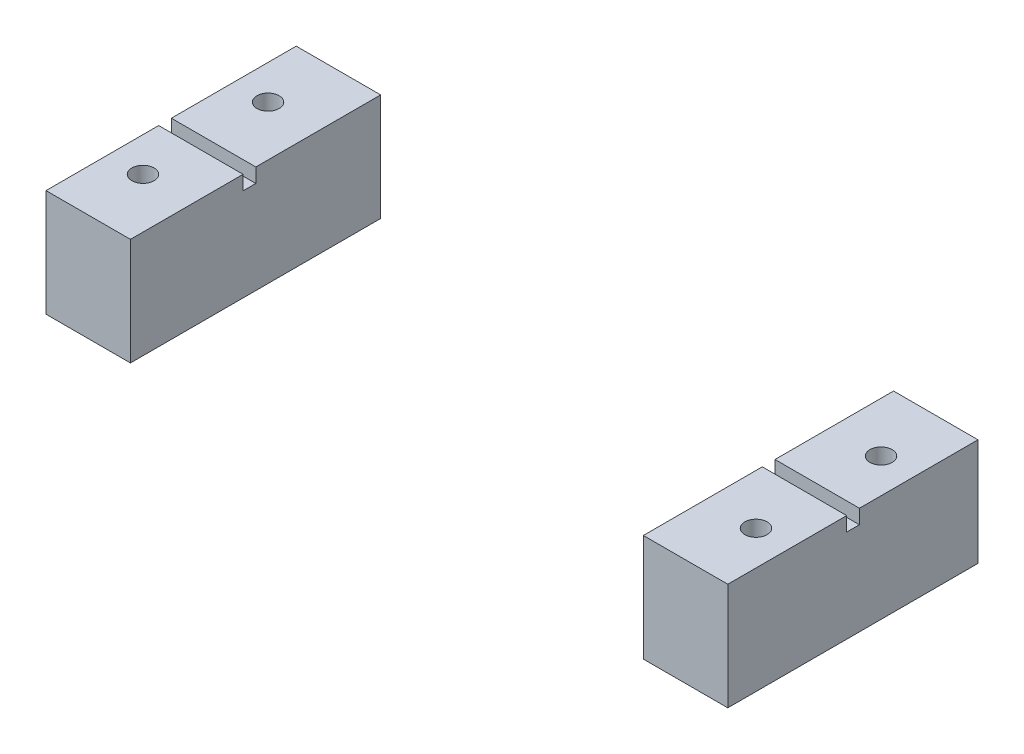
ISO-10303-21;
HEADER;
FILE_DESCRIPTION(('STEP AP214'),'2;1');
FILE_NAME('part.step','',(''),(''),'','','');
FILE_SCHEMA(('AUTOMOTIVE_DESIGN { 1 0 10303 214 1 1 1 1 }'));
ENDSEC;
DATA;
#1=APPLICATION_CONTEXT('core data for automotive mechanical design processes');
#2=APPLICATION_PROTOCOL_DEFINITION('international standard','automotive_design',2000,#1);
#3=PRODUCT_CONTEXT('',#1,'mechanical');
#4=PRODUCT('Part','Part','',(#3));
#5=PRODUCT_RELATED_PRODUCT_CATEGORY('part','',(#4));
#6=PRODUCT_DEFINITION_FORMATION('','',#4);
#7=PRODUCT_DEFINITION_CONTEXT('part definition',#1,'design');
#8=PRODUCT_DEFINITION('design','',#6,#7);
#9=PRODUCT_DEFINITION_SHAPE('','',#8);
#10=(LENGTH_UNIT() NAMED_UNIT(*) SI_UNIT(.MILLI.,.METRE.));
#11=(NAMED_UNIT(*) PLANE_ANGLE_UNIT() SI_UNIT($,.RADIAN.));
#12=(NAMED_UNIT(*) SI_UNIT($,.STERADIAN.) SOLID_ANGLE_UNIT());
#13=UNCERTAINTY_MEASURE_WITH_UNIT(LENGTH_MEASURE(1.E-05),#10,'distance_accuracy_value','');
#14=(GEOMETRIC_REPRESENTATION_CONTEXT(3) GLOBAL_UNCERTAINTY_ASSIGNED_CONTEXT((#13)) GLOBAL_UNIT_ASSIGNED_CONTEXT((#10,
#11,#12)) REPRESENTATION_CONTEXT('',''));
#15=CARTESIAN_POINT('',(0.,0.,0.));
#16=DIRECTION('',(0.,0.,1.));
#17=DIRECTION('',(1.,0.,0.));
#18=AXIS2_PLACEMENT_3D('',#15,#16,#17);
#19=CARTESIAN_POINT('',(0.,8.5598,0.));
#20=DIRECTION('',(0.,1.,0.));
#21=DIRECTION('',(0.,0.,1.));
#22=AXIS2_PLACEMENT_3D('',#19,#20,#21);
#23=PLANE('',#22);
#24=DIRECTION('',(-1.,0.,0.));
#25=VECTOR('',#24,1.);
#26=CARTESIAN_POINT('',(54.5,8.5598,-10.5214854290003));
#27=LINE('',#26,#25);
#28=CARTESIAN_POINT('',(54.5,8.5598,-10.5214854290003));
#29=VERTEX_POINT('',#28);
#30=CARTESIAN_POINT('',(47.75,8.5598,-10.5214854290003));
#31=VERTEX_POINT('',#30);
#32=EDGE_CURVE('E134',#29,#31,#27,.T.);
#33=ORIENTED_EDGE('',*,*,#32,.F.);
#34=DIRECTION('',(0.,0.,-1.));
#35=VECTOR('',#34,1.);
#36=CARTESIAN_POINT('',(54.5,8.5598,0.));
#37=LINE('',#36,#35);
#38=CARTESIAN_POINT('',(54.5,8.5598,-20.));
#39=VERTEX_POINT('',#38);
#40=EDGE_CURVE('E69',#29,#39,#37,.T.);
#41=ORIENTED_EDGE('',*,*,#40,.T.);
#42=DIRECTION('',(1.,0.,0.));
#43=VECTOR('',#42,1.);
#44=CARTESIAN_POINT('',(0.,8.5598,-20.));
#45=LINE('',#44,#43);
#46=CARTESIAN_POINT('',(47.75,8.5598,-20.));
#47=VERTEX_POINT('',#46);
#48=EDGE_CURVE('E149',#47,#39,#45,.T.);
#49=ORIENTED_EDGE('',*,*,#48,.F.);
#50=DIRECTION('',(0.,0.,-1.));
#51=VECTOR('',#50,1.);
#52=CARTESIAN_POINT('',(47.75,8.5598,0.));
#53=LINE('',#52,#51);
#54=EDGE_CURVE('E97',#31,#47,#53,.T.);
#55=ORIENTED_EDGE('',*,*,#54,.F.);
#56=EDGE_LOOP('',(#33,#41,#49,#55));
#57=FACE_BOUND('',#56,.T.);
#58=CARTESIAN_POINT('',(51.75,8.5598,-15.));
#59=DIRECTION('',(0.,1.,0.));
#60=DIRECTION('',(0.,0.,1.));
#61=AXIS2_PLACEMENT_3D('',#58,#59,#60);
#62=CIRCLE('',#61,0.889000000000003);
#63=CARTESIAN_POINT('',(51.75,8.5598,-14.111));
#64=VERTEX_POINT('',#63);
#65=EDGE_CURVE('E146',#64,#64,#62,.T.);
#66=ORIENTED_EDGE('',*,*,#65,.F.);
#67=EDGE_LOOP('',(#66));
#68=FACE_BOUND('',#67,.T.);
#69=ADVANCED_FACE('F45',(#57,#68),#23,.T.);
#70=CARTESIAN_POINT('',(0.,8.5598,-20.));
#71=DIRECTION('',(0.,0.,-1.));
#72=DIRECTION('',(-1.,0.,0.));
#73=AXIS2_PLACEMENT_3D('',#70,#71,#72);
#74=PLANE('',#73);
#75=DIRECTION('',(1.,0.,0.));
#76=VECTOR('',#75,1.);
#77=CARTESIAN_POINT('',(0.,0.,-20.));
#78=LINE('',#77,#76);
#79=CARTESIAN_POINT('',(47.75,0.,-20.));
#80=VERTEX_POINT('',#79);
#81=CARTESIAN_POINT('',(54.5,0.,-20.));
#82=VERTEX_POINT('',#81);
#83=EDGE_CURVE('E165',#80,#82,#78,.T.);
#84=ORIENTED_EDGE('',*,*,#83,.F.);
#85=DIRECTION('',(0.,-1.,0.));
#86=VECTOR('',#85,1.);
#87=CARTESIAN_POINT('',(47.75,8.5598,-20.));
#88=LINE('',#87,#86);
#89=EDGE_CURVE('E12',#47,#80,#88,.T.);
#90=ORIENTED_EDGE('',*,*,#89,.F.);
#91=ORIENTED_EDGE('',*,*,#48,.T.);
#92=DIRECTION('',(0.,-1.,0.));
#93=VECTOR('',#92,1.);
#94=CARTESIAN_POINT('',(54.5,8.5598,-20.));
#95=LINE('',#94,#93);
#96=EDGE_CURVE('E90',#39,#82,#95,.T.);
#97=ORIENTED_EDGE('',*,*,#96,.T.);
#98=EDGE_LOOP('',(#84,#90,#91,#97));
#99=FACE_BOUND('',#98,.T.);
#100=ADVANCED_FACE('F191',(#99),#74,.T.);
#101=CARTESIAN_POINT('',(47.75,8.5598,0.));
#102=DIRECTION('',(-1.,0.,0.));
#103=DIRECTION('',(0.,0.,1.));
#104=AXIS2_PLACEMENT_3D('',#101,#102,#103);
#105=PLANE('',#104);
#106=DIRECTION('',(0.,1.,0.));
#107=VECTOR('',#106,1.);
#108=CARTESIAN_POINT('',(47.75,7.4168,-10.5214854290003));
#109=LINE('',#108,#107);
#110=CARTESIAN_POINT('',(47.75,7.4168,-10.5214854290003));
#111=VERTEX_POINT('',#110);
#112=EDGE_CURVE('E166',#111,#31,#109,.T.);
#113=ORIENTED_EDGE('',*,*,#112,.T.);
#114=ORIENTED_EDGE('',*,*,#54,.T.);
#115=ORIENTED_EDGE('',*,*,#89,.T.);
#116=DIRECTION('',(0.,0.,-1.));
#117=VECTOR('',#116,1.);
#118=CARTESIAN_POINT('',(47.75,0.,0.));
#119=LINE('',#118,#117);
#120=CARTESIAN_POINT('',(47.75,0.,0.));
#121=VERTEX_POINT('',#120);
#122=EDGE_CURVE('E169',#121,#80,#119,.T.);
#123=ORIENTED_EDGE('',*,*,#122,.F.);
#124=DIRECTION('',(0.,-1.,0.));
#125=VECTOR('',#124,1.);
#126=CARTESIAN_POINT('',(47.75,8.5598,0.));
#127=LINE('',#126,#125);
#128=CARTESIAN_POINT('',(47.75,8.5598,0.));
#129=VERTEX_POINT('',#128);
#130=EDGE_CURVE('E53',#129,#121,#127,.T.);
#131=ORIENTED_EDGE('',*,*,#130,.F.);
#132=CARTESIAN_POINT('',(47.75,8.5598,-9.50548542900026));
#133=VERTEX_POINT('',#132);
#134=EDGE_CURVE('E139',#129,#133,#53,.T.);
#135=ORIENTED_EDGE('',*,*,#134,.T.);
#136=DIRECTION('',(0.,1.,0.));
#137=VECTOR('',#136,1.);
#138=CARTESIAN_POINT('',(47.75,7.4168,-9.50548542900026));
#139=LINE('',#138,#137);
#140=CARTESIAN_POINT('',(47.75,7.4168,-9.50548542900026));
#141=VERTEX_POINT('',#140);
#142=EDGE_CURVE('E60',#141,#133,#139,.T.);
#143=ORIENTED_EDGE('',*,*,#142,.F.);
#144=DIRECTION('',(0.,0.,1.));
#145=VECTOR('',#144,1.);
#146=CARTESIAN_POINT('',(47.75,7.4168,-10.5214854290003));
#147=LINE('',#146,#145);
#148=EDGE_CURVE('E127',#111,#141,#147,.T.);
#149=ORIENTED_EDGE('',*,*,#148,.F.);
#150=EDGE_LOOP('',(#113,#114,#115,#123,#131,#135,#143,#149));
#151=FACE_BOUND('',#150,.T.);
#152=ADVANCED_FACE('F137',(#151),#105,.T.);
#153=CARTESIAN_POINT('',(0.,8.5598,0.));
#154=DIRECTION('',(0.,0.,-1.));
#155=DIRECTION('',(-1.,0.,0.));
#156=AXIS2_PLACEMENT_3D('',#153,#154,#155);
#157=PLANE('',#156);
#158=DIRECTION('',(1.,0.,0.));
#159=VECTOR('',#158,1.);
#160=CARTESIAN_POINT('',(0.,0.,0.));
#161=LINE('',#160,#159);
#162=CARTESIAN_POINT('',(54.5,0.,0.));
#163=VERTEX_POINT('',#162);
#164=EDGE_CURVE('E172',#121,#163,#161,.T.);
#165=ORIENTED_EDGE('',*,*,#164,.T.);
#166=DIRECTION('',(0.,-1.,0.));
#167=VECTOR('',#166,1.);
#168=CARTESIAN_POINT('',(54.5,8.5598,0.));
#169=LINE('',#168,#167);
#170=CARTESIAN_POINT('',(54.5,8.5598,0.));
#171=VERTEX_POINT('',#170);
#172=EDGE_CURVE('E180',#171,#163,#169,.T.);
#173=ORIENTED_EDGE('',*,*,#172,.F.);
#174=DIRECTION('',(1.,0.,0.));
#175=VECTOR('',#174,1.);
#176=CARTESIAN_POINT('',(0.,8.5598,0.));
#177=LINE('',#176,#175);
#178=EDGE_CURVE('E153',#129,#171,#177,.T.);
#179=ORIENTED_EDGE('',*,*,#178,.F.);
#180=ORIENTED_EDGE('',*,*,#130,.T.);
#181=EDGE_LOOP('',(#165,#173,#179,#180));
#182=FACE_BOUND('',#181,.T.);
#183=ADVANCED_FACE('F185',(#182),#157,.F.);
#184=CARTESIAN_POINT('',(54.5,8.5598,0.));
#185=DIRECTION('',(-1.,0.,0.));
#186=DIRECTION('',(0.,0.,1.));
#187=AXIS2_PLACEMENT_3D('',#184,#185,#186);
#188=PLANE('',#187);
#189=ORIENTED_EDGE('',*,*,#40,.F.);
#190=DIRECTION('',(0.,1.,0.));
#191=VECTOR('',#190,1.);
#192=CARTESIAN_POINT('',(54.5,7.4168,-10.5214854290003));
#193=LINE('',#192,#191);
#194=CARTESIAN_POINT('',(54.5,7.4168,-10.5214854290003));
#195=VERTEX_POINT('',#194);
#196=EDGE_CURVE('E141',#195,#29,#193,.T.);
#197=ORIENTED_EDGE('',*,*,#196,.F.);
#198=DIRECTION('',(0.,0.,-1.));
#199=VECTOR('',#198,1.);
#200=CARTESIAN_POINT('',(54.5,7.4168,-10.5214854290003));
#201=LINE('',#200,#199);
#202=CARTESIAN_POINT('',(54.5,7.4168,-9.50548542900026));
#203=VERTEX_POINT('',#202);
#204=EDGE_CURVE('E126',#203,#195,#201,.T.);
#205=ORIENTED_EDGE('',*,*,#204,.F.);
#206=DIRECTION('',(0.,1.,0.));
#207=VECTOR('',#206,1.);
#208=CARTESIAN_POINT('',(54.5,7.4168,-9.50548542900026));
#209=LINE('',#208,#207);
#210=CARTESIAN_POINT('',(54.5,8.5598,-9.50548542900026));
#211=VERTEX_POINT('',#210);
#212=EDGE_CURVE('E123',#203,#211,#209,.T.);
#213=ORIENTED_EDGE('',*,*,#212,.T.);
#214=EDGE_CURVE('E156',#171,#211,#37,.T.);
#215=ORIENTED_EDGE('',*,*,#214,.F.);
#216=ORIENTED_EDGE('',*,*,#172,.T.);
#217=DIRECTION('',(0.,0.,-1.));
#218=VECTOR('',#217,1.);
#219=CARTESIAN_POINT('',(54.5,0.,0.));
#220=LINE('',#219,#218);
#221=EDGE_CURVE('E175',#163,#82,#220,.T.);
#222=ORIENTED_EDGE('',*,*,#221,.T.);
#223=ORIENTED_EDGE('',*,*,#96,.F.);
#224=EDGE_LOOP('',(#189,#197,#205,#213,#215,#216,#222,#223));
#225=FACE_BOUND('',#224,.T.);
#226=ADVANCED_FACE('F203',(#225),#188,.F.);
#227=CARTESIAN_POINT('',(51.75,8.5598,-15.));
#228=DIRECTION('',(0.,-1.,0.));
#229=DIRECTION('',(0.,0.,-1.));
#230=AXIS2_PLACEMENT_3D('',#227,#228,#229);
#231=CYLINDRICAL_SURFACE('',#230,0.889000000000003);
#232=ORIENTED_EDGE('',*,*,#65,.T.);
#233=EDGE_LOOP('',(#232));
#234=FACE_BOUND('',#233,.T.);
#235=CARTESIAN_POINT('',(51.75,0.,-15.));
#236=DIRECTION('',(0.,1.,0.));
#237=DIRECTION('',(0.,0.,1.));
#238=AXIS2_PLACEMENT_3D('',#235,#236,#237);
#239=CIRCLE('',#238,0.889000000000003);
#240=CARTESIAN_POINT('',(51.75,0.,-14.111));
#241=VERTEX_POINT('',#240);
#242=EDGE_CURVE('E162',#241,#241,#239,.T.);
#243=ORIENTED_EDGE('',*,*,#242,.F.);
#244=EDGE_LOOP('',(#243));
#245=FACE_BOUND('',#244,.T.);
#246=ADVANCED_FACE('F47',(#234,#245),#231,.F.);
#247=CARTESIAN_POINT('',(51.7500000000001,8.5598,-5.00000000000001));
#248=DIRECTION('',(0.,-1.,0.));
#249=DIRECTION('',(0.,0.,-1.));
#250=AXIS2_PLACEMENT_3D('',#247,#248,#249);
#251=CYLINDRICAL_SURFACE('',#250,0.889000000000003);
#252=CARTESIAN_POINT('',(51.7500000000001,8.5598,-5.00000000000001));
#253=DIRECTION('',(0.,1.,0.));
#254=DIRECTION('',(0.,0.,1.));
#255=AXIS2_PLACEMENT_3D('',#252,#253,#254);
#256=CIRCLE('',#255,0.889000000000003);
#257=CARTESIAN_POINT('',(51.7500000000001,8.5598,-4.11100000000001));
#258=VERTEX_POINT('',#257);
#259=EDGE_CURVE('E159',#258,#258,#256,.T.);
#260=ORIENTED_EDGE('',*,*,#259,.T.);
#261=EDGE_LOOP('',(#260));
#262=FACE_BOUND('',#261,.T.);
#263=CARTESIAN_POINT('',(51.7500000000001,0.,-5.00000000000001));
#264=DIRECTION('',(0.,1.,0.));
#265=DIRECTION('',(0.,0.,1.));
#266=AXIS2_PLACEMENT_3D('',#263,#264,#265);
#267=CIRCLE('',#266,0.889000000000003);
#268=CARTESIAN_POINT('',(51.7500000000001,0.,-4.11100000000001));
#269=VERTEX_POINT('',#268);
#270=EDGE_CURVE('E150',#269,#269,#267,.T.);
#271=ORIENTED_EDGE('',*,*,#270,.F.);
#272=EDGE_LOOP('',(#271));
#273=FACE_BOUND('',#272,.T.);
#274=ADVANCED_FACE('F207',(#262,#273),#251,.F.);
#275=DIRECTION('',(1.,0.,0.));
#276=VECTOR('',#275,1.);
#277=CARTESIAN_POINT('',(54.5,8.5598,-9.50548542900026));
#278=LINE('',#277,#276);
#279=EDGE_CURVE('E309',#133,#211,#278,.T.);
#280=ORIENTED_EDGE('',*,*,#279,.F.);
#281=ORIENTED_EDGE('',*,*,#134,.F.);
#282=ORIENTED_EDGE('',*,*,#178,.T.);
#283=ORIENTED_EDGE('',*,*,#214,.T.);
#284=EDGE_LOOP('',(#280,#281,#282,#283));
#285=FACE_BOUND('',#284,.T.);
#286=ORIENTED_EDGE('',*,*,#259,.F.);
#287=EDGE_LOOP('',(#286));
#288=FACE_BOUND('',#287,.T.);
#289=ADVANCED_FACE('F199',(#285,#288),#23,.T.);
#290=CARTESIAN_POINT('',(0.,0.,0.));
#291=DIRECTION('',(0.,1.,0.));
#292=DIRECTION('',(0.,0.,1.));
#293=AXIS2_PLACEMENT_3D('',#290,#291,#292);
#294=PLANE('',#293);
#295=ORIENTED_EDGE('',*,*,#242,.T.);
#296=EDGE_LOOP('',(#295));
#297=FACE_BOUND('',#296,.T.);
#298=ORIENTED_EDGE('',*,*,#83,.T.);
#299=ORIENTED_EDGE('',*,*,#221,.F.);
#300=ORIENTED_EDGE('',*,*,#164,.F.);
#301=ORIENTED_EDGE('',*,*,#122,.T.);
#302=EDGE_LOOP('',(#298,#299,#300,#301));
#303=FACE_BOUND('',#302,.T.);
#304=ORIENTED_EDGE('',*,*,#270,.T.);
#305=EDGE_LOOP('',(#304));
#306=FACE_BOUND('',#305,.T.);
#307=ADVANCED_FACE('F189',(#297,#303,#306),#294,.F.);
#308=CARTESIAN_POINT('',(54.5,7.4168,-10.5214854290003));
#309=DIRECTION('',(0.,0.,-1.));
#310=DIRECTION('',(-1.,0.,0.));
#311=AXIS2_PLACEMENT_3D('',#308,#309,#310);
#312=PLANE('',#311);
#313=ORIENTED_EDGE('',*,*,#32,.T.);
#314=ORIENTED_EDGE('',*,*,#112,.F.);
#315=DIRECTION('',(-1.,0.,0.));
#316=VECTOR('',#315,1.);
#317=CARTESIAN_POINT('',(54.5,7.4168,-10.5214854290003));
#318=LINE('',#317,#316);
#319=EDGE_CURVE('E133',#195,#111,#318,.T.);
#320=ORIENTED_EDGE('',*,*,#319,.F.);
#321=ORIENTED_EDGE('',*,*,#196,.T.);
#322=EDGE_LOOP('',(#313,#314,#320,#321));
#323=FACE_BOUND('',#322,.T.);
#324=ADVANCED_FACE('F212',(#323),#312,.F.);
#325=CARTESIAN_POINT('',(54.5,7.4168,-9.50548542900026));
#326=DIRECTION('',(0.,0.,1.));
#327=DIRECTION('',(1.,0.,0.));
#328=AXIS2_PLACEMENT_3D('',#325,#326,#327);
#329=PLANE('',#328);
#330=ORIENTED_EDGE('',*,*,#279,.T.);
#331=ORIENTED_EDGE('',*,*,#212,.F.);
#332=DIRECTION('',(1.,0.,0.));
#333=VECTOR('',#332,1.);
#334=CARTESIAN_POINT('',(54.5,7.4168,-9.50548542900026));
#335=LINE('',#334,#333);
#336=EDGE_CURVE('E119',#141,#203,#335,.T.);
#337=ORIENTED_EDGE('',*,*,#336,.F.);
#338=ORIENTED_EDGE('',*,*,#142,.T.);
#339=EDGE_LOOP('',(#330,#331,#337,#338));
#340=FACE_BOUND('',#339,.T.);
#341=ADVANCED_FACE('F121',(#340),#329,.F.);
#342=CARTESIAN_POINT('',(0.,7.4168,0.));
#343=DIRECTION('',(0.,-1.,0.));
#344=DIRECTION('',(0.,0.,-1.));
#345=AXIS2_PLACEMENT_3D('',#342,#343,#344);
#346=PLANE('',#345);
#347=ORIENTED_EDGE('',*,*,#148,.T.);
#348=ORIENTED_EDGE('',*,*,#336,.T.);
#349=ORIENTED_EDGE('',*,*,#204,.T.);
#350=ORIENTED_EDGE('',*,*,#319,.T.);
#351=EDGE_LOOP('',(#347,#348,#349,#350));
#352=FACE_BOUND('',#351,.T.);
#353=ADVANCED_FACE('F131',(#352),#346,.F.);
#354=CLOSED_SHELL('',(#69,#100,#152,#183,#226,#246,#274,#289,#307,#324,#341,#353));
#355=MANIFOLD_SOLID_BREP('B2',#354);
#356=CARTESIAN_POINT('',(0.,8.5598,0.));
#357=DIRECTION('',(0.,1.,0.));
#358=DIRECTION('',(0.,0.,1.));
#359=AXIS2_PLACEMENT_3D('',#356,#357,#358);
#360=PLANE('',#359);
#361=DIRECTION('',(-1.,0.,0.));
#362=VECTOR('',#361,1.);
#363=CARTESIAN_POINT('',(6.75,8.5598,-10.0214854290003));
#364=LINE('',#363,#362);
#365=CARTESIAN_POINT('',(6.75,8.5598,-10.0214854290003));
#366=VERTEX_POINT('',#365);
#367=CARTESIAN_POINT('',(0.,8.5598,-10.0214854290003));
#368=VERTEX_POINT('',#367);
#369=EDGE_CURVE('E408',#366,#368,#364,.T.);
#370=ORIENTED_EDGE('',*,*,#369,.F.);
#371=DIRECTION('',(0.,0.,-1.));
#372=VECTOR('',#371,1.);
#373=CARTESIAN_POINT('',(6.75,8.5598,0.));
#374=LINE('',#373,#372);
#375=CARTESIAN_POINT('',(6.75,8.5598,-20.));
#376=VERTEX_POINT('',#375);
#377=EDGE_CURVE('E428',#366,#376,#374,.T.);
#378=ORIENTED_EDGE('',*,*,#377,.T.);
#379=DIRECTION('',(1.,0.,0.));
#380=VECTOR('',#379,1.);
#381=CARTESIAN_POINT('',(0.,8.5598,-20.));
#382=LINE('',#381,#380);
#383=CARTESIAN_POINT('',(0.,8.5598,-20.));
#384=VERTEX_POINT('',#383);
#385=EDGE_CURVE('E430',#384,#376,#382,.T.);
#386=ORIENTED_EDGE('',*,*,#385,.F.);
#387=DIRECTION('',(0.,0.,-1.));
#388=VECTOR('',#387,1.);
#389=CARTESIAN_POINT('',(0.,8.5598,0.));
#390=LINE('',#389,#388);
#391=EDGE_CURVE('E433',#368,#384,#390,.T.);
#392=ORIENTED_EDGE('',*,*,#391,.F.);
#393=EDGE_LOOP('',(#370,#378,#386,#392));
#394=FACE_BOUND('',#393,.T.);
#395=CARTESIAN_POINT('',(2.75000000000001,8.5598,-15.));
#396=DIRECTION('',(0.,1.,0.));
#397=DIRECTION('',(0.,0.,1.));
#398=AXIS2_PLACEMENT_3D('',#395,#396,#397);
#399=CIRCLE('',#398,0.889);
#400=CARTESIAN_POINT('',(2.75000000000001,8.5598,-14.111));
#401=VERTEX_POINT('',#400);
#402=EDGE_CURVE('E422',#401,#401,#399,.T.);
#403=ORIENTED_EDGE('',*,*,#402,.F.);
#404=EDGE_LOOP('',(#403));
#405=FACE_BOUND('',#404,.T.);
#406=ADVANCED_FACE('F321',(#394,#405),#360,.T.);
#407=CARTESIAN_POINT('',(0.,8.5598,0.));
#408=DIRECTION('',(0.,0.,-1.));
#409=DIRECTION('',(-1.,0.,0.));
#410=AXIS2_PLACEMENT_3D('',#407,#408,#409);
#411=PLANE('',#410);
#412=DIRECTION('',(1.,0.,0.));
#413=VECTOR('',#412,1.);
#414=CARTESIAN_POINT('',(0.,0.,0.));
#415=LINE('',#414,#413);
#416=CARTESIAN_POINT('',(0.,0.,0.));
#417=VERTEX_POINT('',#416);
#418=CARTESIAN_POINT('',(6.75,0.,0.));
#419=VERTEX_POINT('',#418);
#420=EDGE_CURVE('E442',#417,#419,#415,.T.);
#421=ORIENTED_EDGE('',*,*,#420,.T.);
#422=DIRECTION('',(0.,-1.,0.));
#423=VECTOR('',#422,1.);
#424=CARTESIAN_POINT('',(6.75,8.5598,0.));
#425=LINE('',#424,#423);
#426=CARTESIAN_POINT('',(6.75,8.5598,0.));
#427=VERTEX_POINT('',#426);
#428=EDGE_CURVE('E43',#427,#419,#425,.T.);
#429=ORIENTED_EDGE('',*,*,#428,.F.);
#430=DIRECTION('',(1.,0.,0.));
#431=VECTOR('',#430,1.);
#432=CARTESIAN_POINT('',(0.,8.5598,0.));
#433=LINE('',#432,#431);
#434=CARTESIAN_POINT('',(0.,8.5598,0.));
#435=VERTEX_POINT('',#434);
#436=EDGE_CURVE('E426',#435,#427,#433,.T.);
#437=ORIENTED_EDGE('',*,*,#436,.F.);
#438=DIRECTION('',(0.,-1.,0.));
#439=VECTOR('',#438,1.);
#440=CARTESIAN_POINT('',(0.,8.5598,0.));
#441=LINE('',#440,#439);
#442=EDGE_CURVE('E345',#435,#417,#441,.T.);
#443=ORIENTED_EDGE('',*,*,#442,.T.);
#444=EDGE_LOOP('',(#421,#429,#437,#443));
#445=FACE_BOUND('',#444,.T.);
#446=ADVANCED_FACE('F489',(#445),#411,.F.);
#447=CARTESIAN_POINT('',(6.75,8.5598,0.));
#448=DIRECTION('',(-1.,0.,0.));
#449=DIRECTION('',(0.,0.,1.));
#450=AXIS2_PLACEMENT_3D('',#447,#448,#449);
#451=PLANE('',#450);
#452=ORIENTED_EDGE('',*,*,#377,.F.);
#453=DIRECTION('',(0.,1.,0.));
#454=VECTOR('',#453,1.);
#455=CARTESIAN_POINT('',(6.75,7.4168,-10.0214854290003));
#456=LINE('',#455,#454);
#457=CARTESIAN_POINT('',(6.75,7.4168,-10.0214854290003));
#458=VERTEX_POINT('',#457);
#459=EDGE_CURVE('E414',#458,#366,#456,.T.);
#460=ORIENTED_EDGE('',*,*,#459,.F.);
#461=DIRECTION('',(0.,0.,-1.));
#462=VECTOR('',#461,1.);
#463=CARTESIAN_POINT('',(6.75,7.4168,-10.0214854290003));
#464=LINE('',#463,#462);
#465=CARTESIAN_POINT('',(6.75,7.4168,-9.00548542900026));
#466=VERTEX_POINT('',#465);
#467=EDGE_CURVE('E399',#466,#458,#464,.T.);
#468=ORIENTED_EDGE('',*,*,#467,.F.);
#469=DIRECTION('',(0.,1.,0.));
#470=VECTOR('',#469,1.);
#471=CARTESIAN_POINT('',(6.75,7.4168,-9.00548542900026));
#472=LINE('',#471,#470);
#473=CARTESIAN_POINT('',(6.75,8.5598,-9.00548542900026));
#474=VERTEX_POINT('',#473);
#475=EDGE_CURVE('E396',#466,#474,#472,.T.);
#476=ORIENTED_EDGE('',*,*,#475,.T.);
#477=EDGE_CURVE('E371',#427,#474,#374,.T.);
#478=ORIENTED_EDGE('',*,*,#477,.F.);
#479=ORIENTED_EDGE('',*,*,#428,.T.);
#480=DIRECTION('',(0.,0.,-1.));
#481=VECTOR('',#480,1.);
#482=CARTESIAN_POINT('',(6.75,0.,0.));
#483=LINE('',#482,#481);
#484=CARTESIAN_POINT('',(6.75,0.,-20.));
#485=VERTEX_POINT('',#484);
#486=EDGE_CURVE('E444',#419,#485,#483,.T.);
#487=ORIENTED_EDGE('',*,*,#486,.T.);
#488=DIRECTION('',(0.,-1.,0.));
#489=VECTOR('',#488,1.);
#490=CARTESIAN_POINT('',(6.75,8.5598,-20.));
#491=LINE('',#490,#489);
#492=EDGE_CURVE('E329',#376,#485,#491,.T.);
#493=ORIENTED_EDGE('',*,*,#492,.F.);
#494=EDGE_LOOP('',(#452,#460,#468,#476,#478,#479,#487,#493));
#495=FACE_BOUND('',#494,.T.);
#496=ADVANCED_FACE('F461',(#495),#451,.F.);
#497=CARTESIAN_POINT('',(0.,8.5598,-20.));
#498=DIRECTION('',(0.,0.,-1.));
#499=DIRECTION('',(-1.,0.,0.));
#500=AXIS2_PLACEMENT_3D('',#497,#498,#499);
#501=PLANE('',#500);
#502=DIRECTION('',(1.,0.,0.));
#503=VECTOR('',#502,1.);
#504=CARTESIAN_POINT('',(0.,0.,-20.));
#505=LINE('',#504,#503);
#506=CARTESIAN_POINT('',(0.,0.,-20.));
#507=VERTEX_POINT('',#506);
#508=EDGE_CURVE('E447',#507,#485,#505,.T.);
#509=ORIENTED_EDGE('',*,*,#508,.F.);
#510=DIRECTION('',(0.,-1.,0.));
#511=VECTOR('',#510,1.);
#512=CARTESIAN_POINT('',(0.,8.5598,-20.));
#513=LINE('',#512,#511);
#514=EDGE_CURVE('E453',#384,#507,#513,.T.);
#515=ORIENTED_EDGE('',*,*,#514,.F.);
#516=ORIENTED_EDGE('',*,*,#385,.T.);
#517=ORIENTED_EDGE('',*,*,#492,.T.);
#518=EDGE_LOOP('',(#509,#515,#516,#517));
#519=FACE_BOUND('',#518,.T.);
#520=ADVANCED_FACE('F457',(#519),#501,.T.);
#521=CARTESIAN_POINT('',(2.75000000000001,8.5598,-15.));
#522=DIRECTION('',(0.,-1.,0.));
#523=DIRECTION('',(0.,0.,-1.));
#524=AXIS2_PLACEMENT_3D('',#521,#522,#523);
#525=CYLINDRICAL_SURFACE('',#524,0.889);
#526=ORIENTED_EDGE('',*,*,#402,.T.);
#527=EDGE_LOOP('',(#526));
#528=FACE_BOUND('',#527,.T.);
#529=CARTESIAN_POINT('',(2.75000000000001,0.,-15.));
#530=DIRECTION('',(0.,1.,0.));
#531=DIRECTION('',(0.,0.,1.));
#532=AXIS2_PLACEMENT_3D('',#529,#530,#531);
#533=CIRCLE('',#532,0.889);
#534=CARTESIAN_POINT('',(2.75000000000001,0.,-14.111));
#535=VERTEX_POINT('',#534);
#536=EDGE_CURVE('E438',#535,#535,#533,.T.);
#537=ORIENTED_EDGE('',*,*,#536,.F.);
#538=EDGE_LOOP('',(#537));
#539=FACE_BOUND('',#538,.T.);
#540=ADVANCED_FACE('F506',(#528,#539),#525,.F.);
#541=CARTESIAN_POINT('',(2.75000000000015,8.5598,-5.));
#542=DIRECTION('',(0.,-1.,0.));
#543=DIRECTION('',(0.,0.,-1.));
#544=AXIS2_PLACEMENT_3D('',#541,#542,#543);
#545=CYLINDRICAL_SURFACE('',#544,0.889);
#546=CARTESIAN_POINT('',(2.75000000000015,8.5598,-5.));
#547=DIRECTION('',(0.,1.,0.));
#548=DIRECTION('',(0.,0.,1.));
#549=AXIS2_PLACEMENT_3D('',#546,#547,#548);
#550=CIRCLE('',#549,0.889);
#551=CARTESIAN_POINT('',(2.75000000000015,8.5598,-4.111));
#552=VERTEX_POINT('',#551);
#553=EDGE_CURVE('E419',#552,#552,#550,.T.);
#554=ORIENTED_EDGE('',*,*,#553,.T.);
#555=EDGE_LOOP('',(#554));
#556=FACE_BOUND('',#555,.T.);
#557=CARTESIAN_POINT('',(2.75000000000015,0.,-5.));
#558=DIRECTION('',(0.,1.,0.));
#559=DIRECTION('',(0.,0.,1.));
#560=AXIS2_PLACEMENT_3D('',#557,#558,#559);
#561=CIRCLE('',#560,0.889);
#562=CARTESIAN_POINT('',(2.75000000000015,0.,-4.111));
#563=VERTEX_POINT('',#562);
#564=EDGE_CURVE('E435',#563,#563,#561,.T.);
#565=ORIENTED_EDGE('',*,*,#564,.F.);
#566=EDGE_LOOP('',(#565));
#567=FACE_BOUND('',#566,.T.);
#568=ADVANCED_FACE('F323',(#556,#567),#545,.F.);
#569=CARTESIAN_POINT('',(0.,8.5598,0.));
#570=DIRECTION('',(-1.,0.,0.));
#571=DIRECTION('',(0.,0.,1.));
#572=AXIS2_PLACEMENT_3D('',#569,#570,#571);
#573=PLANE('',#572);
#574=DIRECTION('',(0.,1.,0.));
#575=VECTOR('',#574,1.);
#576=CARTESIAN_POINT('',(0.,7.4168,-10.0214854290003));
#577=LINE('',#576,#575);
#578=CARTESIAN_POINT('',(0.,7.4168,-10.0214854290003));
#579=VERTEX_POINT('',#578);
#580=EDGE_CURVE('E439',#579,#368,#577,.T.);
#581=ORIENTED_EDGE('',*,*,#580,.T.);
#582=ORIENTED_EDGE('',*,*,#391,.T.);
#583=ORIENTED_EDGE('',*,*,#514,.T.);
#584=DIRECTION('',(0.,0.,-1.));
#585=VECTOR('',#584,1.);
#586=CARTESIAN_POINT('',(0.,0.,0.));
#587=LINE('',#586,#585);
#588=EDGE_CURVE('E423',#417,#507,#587,.T.);
#589=ORIENTED_EDGE('',*,*,#588,.F.);
#590=ORIENTED_EDGE('',*,*,#442,.F.);
#591=CARTESIAN_POINT('',(0.,8.5598,-9.00548542900026));
#592=VERTEX_POINT('',#591);
#593=EDGE_CURVE('E412',#435,#592,#390,.T.);
#594=ORIENTED_EDGE('',*,*,#593,.T.);
#595=DIRECTION('',(0.,1.,0.));
#596=VECTOR('',#595,1.);
#597=CARTESIAN_POINT('',(0.,7.4168,-9.00548542900026));
#598=LINE('',#597,#596);
#599=CARTESIAN_POINT('',(0.,7.4168,-9.00548542900026));
#600=VERTEX_POINT('',#599);
#601=EDGE_CURVE('E336',#600,#592,#598,.T.);
#602=ORIENTED_EDGE('',*,*,#601,.F.);
#603=DIRECTION('',(0.,0.,1.));
#604=VECTOR('',#603,1.);
#605=CARTESIAN_POINT('',(0.,7.4168,-10.0214854290003));
#606=LINE('',#605,#604);
#607=EDGE_CURVE('E400',#579,#600,#606,.T.);
#608=ORIENTED_EDGE('',*,*,#607,.F.);
#609=EDGE_LOOP('',(#581,#582,#583,#589,#590,#594,#602,#608));
#610=FACE_BOUND('',#609,.T.);
#611=ADVANCED_FACE('F410',(#610),#573,.T.);
#612=DIRECTION('',(1.,0.,0.));
#613=VECTOR('',#612,1.);
#614=CARTESIAN_POINT('',(6.75,8.5598,-9.00548542900026));
#615=LINE('',#614,#613);
#616=EDGE_CURVE('E474',#592,#474,#615,.T.);
#617=ORIENTED_EDGE('',*,*,#616,.F.);
#618=ORIENTED_EDGE('',*,*,#593,.F.);
#619=ORIENTED_EDGE('',*,*,#436,.T.);
#620=ORIENTED_EDGE('',*,*,#477,.T.);
#621=EDGE_LOOP('',(#617,#618,#619,#620));
#622=FACE_BOUND('',#621,.T.);
#623=ORIENTED_EDGE('',*,*,#553,.F.);
#624=EDGE_LOOP('',(#623));
#625=FACE_BOUND('',#624,.T.);
#626=ADVANCED_FACE('F484',(#622,#625),#360,.T.);
#627=CARTESIAN_POINT('',(0.,0.,0.));
#628=DIRECTION('',(0.,1.,0.));
#629=DIRECTION('',(0.,0.,1.));
#630=AXIS2_PLACEMENT_3D('',#627,#628,#629);
#631=PLANE('',#630);
#632=ORIENTED_EDGE('',*,*,#564,.T.);
#633=EDGE_LOOP('',(#632));
#634=FACE_BOUND('',#633,.T.);
#635=ORIENTED_EDGE('',*,*,#536,.T.);
#636=EDGE_LOOP('',(#635));
#637=FACE_BOUND('',#636,.T.);
#638=ORIENTED_EDGE('',*,*,#420,.F.);
#639=ORIENTED_EDGE('',*,*,#588,.T.);
#640=ORIENTED_EDGE('',*,*,#508,.T.);
#641=ORIENTED_EDGE('',*,*,#486,.F.);
#642=EDGE_LOOP('',(#638,#639,#640,#641));
#643=FACE_BOUND('',#642,.T.);
#644=ADVANCED_FACE('F464',(#634,#637,#643),#631,.F.);
#645=CARTESIAN_POINT('',(6.75,7.4168,-10.0214854290003));
#646=DIRECTION('',(0.,0.,-1.));
#647=DIRECTION('',(-1.,0.,0.));
#648=AXIS2_PLACEMENT_3D('',#645,#646,#647);
#649=PLANE('',#648);
#650=ORIENTED_EDGE('',*,*,#369,.T.);
#651=ORIENTED_EDGE('',*,*,#580,.F.);
#652=DIRECTION('',(-1.,0.,0.));
#653=VECTOR('',#652,1.);
#654=CARTESIAN_POINT('',(6.75,7.4168,-10.0214854290003));
#655=LINE('',#654,#653);
#656=EDGE_CURVE('E406',#458,#579,#655,.T.);
#657=ORIENTED_EDGE('',*,*,#656,.F.);
#658=ORIENTED_EDGE('',*,*,#459,.T.);
#659=EDGE_LOOP('',(#650,#651,#657,#658));
#660=FACE_BOUND('',#659,.T.);
#661=ADVANCED_FACE('F476',(#660),#649,.F.);
#662=CARTESIAN_POINT('',(6.75,7.4168,-9.00548542900026));
#663=DIRECTION('',(0.,0.,1.));
#664=DIRECTION('',(1.,0.,0.));
#665=AXIS2_PLACEMENT_3D('',#662,#663,#664);
#666=PLANE('',#665);
#667=ORIENTED_EDGE('',*,*,#616,.T.);
#668=ORIENTED_EDGE('',*,*,#475,.F.);
#669=DIRECTION('',(1.,0.,0.));
#670=VECTOR('',#669,1.);
#671=CARTESIAN_POINT('',(6.75,7.4168,-9.00548542900026));
#672=LINE('',#671,#670);
#673=EDGE_CURVE('E393',#600,#466,#672,.T.);
#674=ORIENTED_EDGE('',*,*,#673,.F.);
#675=ORIENTED_EDGE('',*,*,#601,.T.);
#676=EDGE_LOOP('',(#667,#668,#674,#675));
#677=FACE_BOUND('',#676,.T.);
#678=ADVANCED_FACE('F395',(#677),#666,.F.);
#679=CARTESIAN_POINT('',(0.,7.4168,0.));
#680=DIRECTION('',(0.,-1.,0.));
#681=DIRECTION('',(0.,0.,-1.));
#682=AXIS2_PLACEMENT_3D('',#679,#680,#681);
#683=PLANE('',#682);
#684=ORIENTED_EDGE('',*,*,#607,.T.);
#685=ORIENTED_EDGE('',*,*,#673,.T.);
#686=ORIENTED_EDGE('',*,*,#467,.T.);
#687=ORIENTED_EDGE('',*,*,#656,.T.);
#688=EDGE_LOOP('',(#684,#685,#686,#687));
#689=FACE_BOUND('',#688,.T.);
#690=ADVANCED_FACE('F404',(#689),#683,.F.);
#691=CLOSED_SHELL('',(#406,#446,#496,#520,#540,#568,#611,#626,#644,#661,#678,#690));
#692=MANIFOLD_SOLID_BREP('B6',#691);
#693=ADVANCED_BREP_SHAPE_REPRESENTATION('',(#18,#355,#692),#14);
#694=SHAPE_DEFINITION_REPRESENTATION(#9,#693);
ENDSEC;
END-ISO-10303-21;
